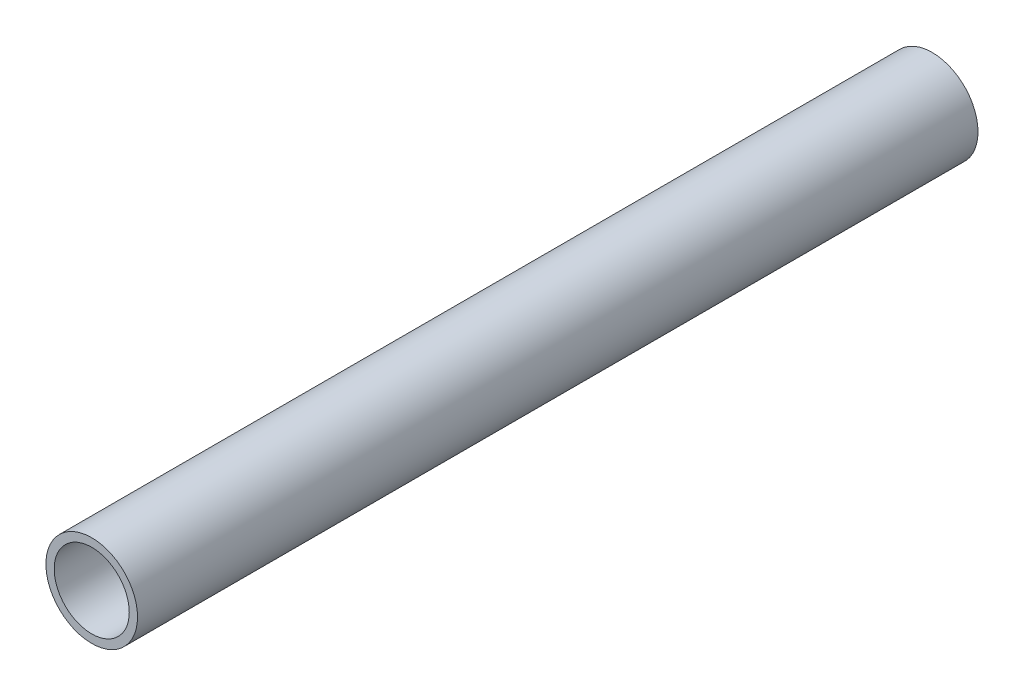
ISO-10303-21;
HEADER;
FILE_DESCRIPTION(('STEP AP214'),'2;1');
FILE_NAME('part.step','',(''),(''),'','','');
FILE_SCHEMA(('AUTOMOTIVE_DESIGN { 1 0 10303 214 1 1 1 1 }'));
ENDSEC;
DATA;
#1=APPLICATION_CONTEXT('core data for automotive mechanical design processes');
#2=APPLICATION_PROTOCOL_DEFINITION('international standard','automotive_design',2000,#1);
#3=PRODUCT_CONTEXT('',#1,'mechanical');
#4=PRODUCT('Part','Part','',(#3));
#5=PRODUCT_RELATED_PRODUCT_CATEGORY('part','',(#4));
#6=PRODUCT_DEFINITION_FORMATION('','',#4);
#7=PRODUCT_DEFINITION_CONTEXT('part definition',#1,'design');
#8=PRODUCT_DEFINITION('design','',#6,#7);
#9=PRODUCT_DEFINITION_SHAPE('','',#8);
#10=(LENGTH_UNIT() NAMED_UNIT(*) SI_UNIT(.MILLI.,.METRE.));
#11=(NAMED_UNIT(*) PLANE_ANGLE_UNIT() SI_UNIT($,.RADIAN.));
#12=(NAMED_UNIT(*) SI_UNIT($,.STERADIAN.) SOLID_ANGLE_UNIT());
#13=UNCERTAINTY_MEASURE_WITH_UNIT(LENGTH_MEASURE(1.E-05),#10,'distance_accuracy_value','');
#14=(GEOMETRIC_REPRESENTATION_CONTEXT(3) GLOBAL_UNCERTAINTY_ASSIGNED_CONTEXT((#13)) GLOBAL_UNIT_ASSIGNED_CONTEXT((#10,
#11,#12)) REPRESENTATION_CONTEXT('',''));
#15=CARTESIAN_POINT('',(0.,0.,0.));
#16=DIRECTION('',(0.,0.,1.));
#17=DIRECTION('',(1.,0.,0.));
#18=AXIS2_PLACEMENT_3D('',#15,#16,#17);
#19=CARTESIAN_POINT('',(0.,0.,-142.2));
#20=DIRECTION('',(0.,0.,-1.));
#21=DIRECTION('',(1.,0.,0.));
#22=AXIS2_PLACEMENT_3D('',#19,#20,#21);
#23=PLANE('',#22);
#24=CARTESIAN_POINT('',(0.,0.,-142.2));
#25=DIRECTION('',(0.,0.,1.));
#26=DIRECTION('',(1.,0.,0.));
#27=AXIS2_PLACEMENT_3D('',#24,#25,#26);
#28=CIRCLE('',#27,7.75);
#29=CARTESIAN_POINT('',(7.75,0.,-142.2));
#30=VERTEX_POINT('',#29);
#31=EDGE_CURVE('E10',#30,#30,#28,.T.);
#32=ORIENTED_EDGE('',*,*,#31,.F.);
#33=EDGE_LOOP('',(#32));
#34=FACE_BOUND('',#33,.T.);
#35=CARTESIAN_POINT('',(0.,0.,-142.2));
#36=DIRECTION('',(0.,0.,1.));
#37=DIRECTION('',(1.,0.,0.));
#38=AXIS2_PLACEMENT_3D('',#35,#36,#37);
#39=CIRCLE('',#38,6.35);
#40=CARTESIAN_POINT('',(6.35,0.,-142.2));
#41=VERTEX_POINT('',#40);
#42=EDGE_CURVE('E46',#41,#41,#39,.T.);
#43=ORIENTED_EDGE('',*,*,#42,.T.);
#44=EDGE_LOOP('',(#43));
#45=FACE_BOUND('',#44,.T.);
#46=ADVANCED_FACE('F35',(#34,#45),#23,.T.);
#47=CARTESIAN_POINT('',(0.,0.,0.));
#48=DIRECTION('',(0.,0.,-1.));
#49=DIRECTION('',(1.,0.,0.));
#50=AXIS2_PLACEMENT_3D('',#47,#48,#49);
#51=PLANE('',#50);
#52=CARTESIAN_POINT('',(0.,0.,0.));
#53=DIRECTION('',(0.,0.,1.));
#54=DIRECTION('',(1.,0.,0.));
#55=AXIS2_PLACEMENT_3D('',#52,#53,#54);
#56=CIRCLE('',#55,7.75);
#57=CARTESIAN_POINT('',(7.75,0.,0.));
#58=VERTEX_POINT('',#57);
#59=EDGE_CURVE('E39',#58,#58,#56,.T.);
#60=ORIENTED_EDGE('',*,*,#59,.T.);
#61=EDGE_LOOP('',(#60));
#62=FACE_BOUND('',#61,.T.);
#63=CARTESIAN_POINT('',(0.,0.,0.));
#64=DIRECTION('',(0.,0.,1.));
#65=DIRECTION('',(1.,0.,0.));
#66=AXIS2_PLACEMENT_3D('',#63,#64,#65);
#67=CIRCLE('',#66,6.35);
#68=CARTESIAN_POINT('',(6.35,0.,0.));
#69=VERTEX_POINT('',#68);
#70=EDGE_CURVE('E48',#69,#69,#67,.T.);
#71=ORIENTED_EDGE('',*,*,#70,.F.);
#72=EDGE_LOOP('',(#71));
#73=FACE_BOUND('',#72,.T.);
#74=ADVANCED_FACE('F61',(#62,#73),#51,.F.);
#75=CARTESIAN_POINT('',(0.,0.,-142.2));
#76=DIRECTION('',(0.,0.,1.));
#77=DIRECTION('',(-1.,0.,0.));
#78=AXIS2_PLACEMENT_3D('',#75,#76,#77);
#79=CYLINDRICAL_SURFACE('',#78,7.75);
#80=ORIENTED_EDGE('',*,*,#31,.T.);
#81=EDGE_LOOP('',(#80));
#82=FACE_BOUND('',#81,.T.);
#83=ORIENTED_EDGE('',*,*,#59,.F.);
#84=EDGE_LOOP('',(#83));
#85=FACE_BOUND('',#84,.T.);
#86=ADVANCED_FACE('F37',(#82,#85),#79,.T.);
#87=CARTESIAN_POINT('',(0.,0.,-142.2));
#88=DIRECTION('',(0.,0.,1.));
#89=DIRECTION('',(-1.,0.,0.));
#90=AXIS2_PLACEMENT_3D('',#87,#88,#89);
#91=CYLINDRICAL_SURFACE('',#90,6.35);
#92=ORIENTED_EDGE('',*,*,#42,.F.);
#93=EDGE_LOOP('',(#92));
#94=FACE_BOUND('',#93,.T.);
#95=ORIENTED_EDGE('',*,*,#70,.T.);
#96=EDGE_LOOP('',(#95));
#97=FACE_BOUND('',#96,.T.);
#98=ADVANCED_FACE('F55',(#94,#97),#91,.F.);
#99=CLOSED_SHELL('',(#46,#74,#86,#98));
#100=MANIFOLD_SOLID_BREP('B2',#99);
#101=ADVANCED_BREP_SHAPE_REPRESENTATION('',(#18,#100),#14);
#102=SHAPE_DEFINITION_REPRESENTATION(#9,#101);
ENDSEC;
END-ISO-10303-21;
